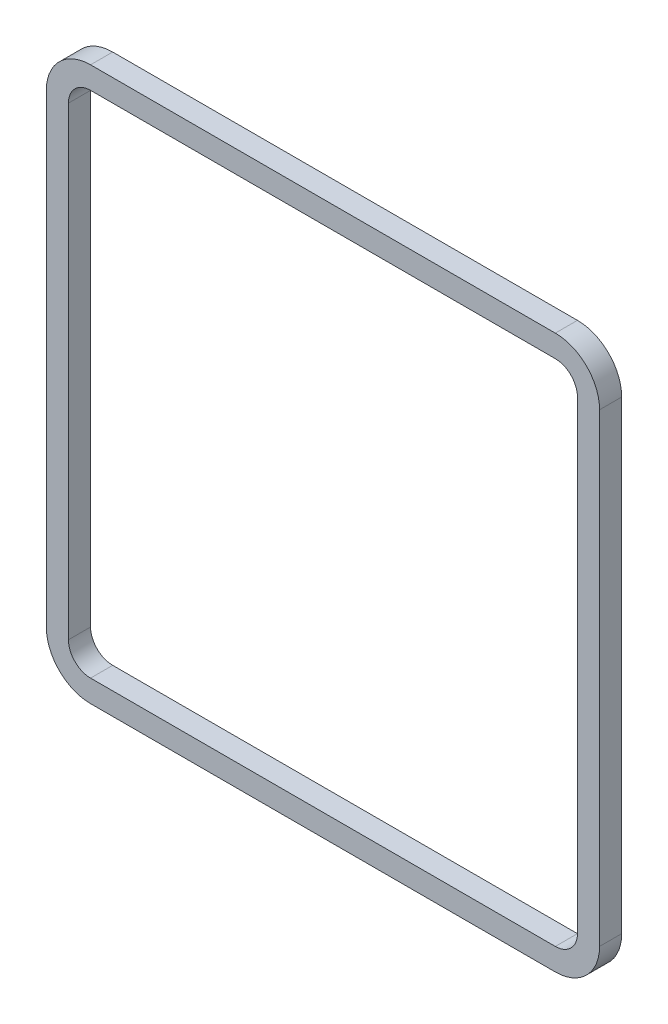
ISO-10303-21;
HEADER;
FILE_DESCRIPTION(('STEP AP214'),'2;1');
FILE_NAME('part.step','',(''),(''),'','','');
FILE_SCHEMA(('AUTOMOTIVE_DESIGN { 1 0 10303 214 1 1 1 1 }'));
ENDSEC;
DATA;
#1=APPLICATION_CONTEXT('core data for automotive mechanical design processes');
#2=APPLICATION_PROTOCOL_DEFINITION('international standard','automotive_design',2000,#1);
#3=PRODUCT_CONTEXT('',#1,'mechanical');
#4=PRODUCT('Part','Part','',(#3));
#5=PRODUCT_RELATED_PRODUCT_CATEGORY('part','',(#4));
#6=PRODUCT_DEFINITION_FORMATION('','',#4);
#7=PRODUCT_DEFINITION_CONTEXT('part definition',#1,'design');
#8=PRODUCT_DEFINITION('design','',#6,#7);
#9=PRODUCT_DEFINITION_SHAPE('','',#8);
#10=(LENGTH_UNIT() NAMED_UNIT(*) SI_UNIT(.MILLI.,.METRE.));
#11=(NAMED_UNIT(*) PLANE_ANGLE_UNIT() SI_UNIT($,.RADIAN.));
#12=(NAMED_UNIT(*) SI_UNIT($,.STERADIAN.) SOLID_ANGLE_UNIT());
#13=UNCERTAINTY_MEASURE_WITH_UNIT(LENGTH_MEASURE(1.E-05),#10,'distance_accuracy_value','');
#14=(GEOMETRIC_REPRESENTATION_CONTEXT(3) GLOBAL_UNCERTAINTY_ASSIGNED_CONTEXT((#13)) GLOBAL_UNIT_ASSIGNED_CONTEXT((#10,
#11,#12)) REPRESENTATION_CONTEXT('',''));
#15=CARTESIAN_POINT('',(0.,0.,0.));
#16=DIRECTION('',(0.,0.,1.));
#17=DIRECTION('',(1.,0.,0.));
#18=AXIS2_PLACEMENT_3D('',#15,#16,#17);
#19=CARTESIAN_POINT('',(53.34,53.34,5.08));
#20=DIRECTION('',(0.,0.,1.));
#21=DIRECTION('',(1.,0.,0.));
#22=AXIS2_PLACEMENT_3D('',#19,#20,#21);
#23=PLANE('',#22);
#24=CARTESIAN_POINT('',(53.34,53.34,5.08));
#25=DIRECTION('',(0.,0.,1.));
#26=DIRECTION('',(1.,0.,0.));
#27=AXIS2_PLACEMENT_3D('',#24,#25,#26);
#28=CIRCLE('',#27,10.16);
#29=CARTESIAN_POINT('',(63.5,53.3399999999999,5.08));
#30=VERTEX_POINT('',#29);
#31=CARTESIAN_POINT('',(53.3399999999999,63.5,5.08));
#32=VERTEX_POINT('',#31);
#33=EDGE_CURVE('E215',#30,#32,#28,.T.);
#34=ORIENTED_EDGE('',*,*,#33,.T.);
#35=DIRECTION('',(-1.,0.,0.));
#36=VECTOR('',#35,1.);
#37=CARTESIAN_POINT('',(53.3399999999999,63.5,5.08));
#38=LINE('',#37,#36);
#39=CARTESIAN_POINT('',(-53.3399999999999,63.5,5.08));
#40=VERTEX_POINT('',#39);
#41=EDGE_CURVE('E218',#32,#40,#38,.T.);
#42=ORIENTED_EDGE('',*,*,#41,.T.);
#43=CARTESIAN_POINT('',(-53.34,53.34,5.08));
#44=DIRECTION('',(0.,0.,1.));
#45=DIRECTION('',(1.,0.,0.));
#46=AXIS2_PLACEMENT_3D('',#43,#44,#45);
#47=CIRCLE('',#46,10.16);
#48=CARTESIAN_POINT('',(-63.5,53.3399999999999,5.08));
#49=VERTEX_POINT('',#48);
#50=EDGE_CURVE('E221',#40,#49,#47,.T.);
#51=ORIENTED_EDGE('',*,*,#50,.T.);
#52=DIRECTION('',(0.,-1.,0.));
#53=VECTOR('',#52,1.);
#54=CARTESIAN_POINT('',(-63.5,53.3399999999999,5.08));
#55=LINE('',#54,#53);
#56=CARTESIAN_POINT('',(-63.5,-53.34,5.08));
#57=VERTEX_POINT('',#56);
#58=EDGE_CURVE('E223',#49,#57,#55,.T.);
#59=ORIENTED_EDGE('',*,*,#58,.T.);
#60=CARTESIAN_POINT('',(-53.34,-53.34,5.08));
#61=DIRECTION('',(0.,0.,1.));
#62=DIRECTION('',(1.,0.,0.));
#63=AXIS2_PLACEMENT_3D('',#60,#61,#62);
#64=CIRCLE('',#63,10.16);
#65=CARTESIAN_POINT('',(-53.3399999999999,-63.5,5.08));
#66=VERTEX_POINT('',#65);
#67=EDGE_CURVE('E225',#57,#66,#64,.T.);
#68=ORIENTED_EDGE('',*,*,#67,.T.);
#69=DIRECTION('',(1.,0.,0.));
#70=VECTOR('',#69,1.);
#71=CARTESIAN_POINT('',(53.3399999999999,-63.5,5.08));
#72=LINE('',#71,#70);
#73=CARTESIAN_POINT('',(53.3399999999999,-63.5,5.08));
#74=VERTEX_POINT('',#73);
#75=EDGE_CURVE('E227',#66,#74,#72,.T.);
#76=ORIENTED_EDGE('',*,*,#75,.T.);
#77=CARTESIAN_POINT('',(53.34,-53.34,5.08));
#78=DIRECTION('',(0.,0.,1.));
#79=DIRECTION('',(1.,0.,0.));
#80=AXIS2_PLACEMENT_3D('',#77,#78,#79);
#81=CIRCLE('',#80,10.16);
#82=CARTESIAN_POINT('',(63.5,-53.3399999999999,5.08));
#83=VERTEX_POINT('',#82);
#84=EDGE_CURVE('E229',#74,#83,#81,.T.);
#85=ORIENTED_EDGE('',*,*,#84,.T.);
#86=DIRECTION('',(0.,1.,0.));
#87=VECTOR('',#86,1.);
#88=CARTESIAN_POINT('',(63.5,53.3399999999999,5.08));
#89=LINE('',#88,#87);
#90=EDGE_CURVE('E231',#83,#30,#89,.T.);
#91=ORIENTED_EDGE('',*,*,#90,.T.);
#92=EDGE_LOOP('',(#34,#42,#51,#59,#68,#76,#85,#91));
#93=FACE_BOUND('',#92,.T.);
#94=DIRECTION('',(-1.,0.,0.));
#95=VECTOR('',#94,1.);
#96=CARTESIAN_POINT('',(53.3399999999999,58.42,5.08));
#97=LINE('',#96,#95);
#98=CARTESIAN_POINT('',(53.3399999999999,58.42,5.08));
#99=VERTEX_POINT('',#98);
#100=CARTESIAN_POINT('',(-53.3399999999999,58.42,5.08));
#101=VERTEX_POINT('',#100);
#102=EDGE_CURVE('E158',#99,#101,#97,.T.);
#103=ORIENTED_EDGE('',*,*,#102,.F.);
#104=CARTESIAN_POINT('',(53.34,53.34,5.08));
#105=DIRECTION('',(0.,0.,1.));
#106=DIRECTION('',(1.,0.,0.));
#107=AXIS2_PLACEMENT_3D('',#104,#105,#106);
#108=CIRCLE('',#107,5.08);
#109=CARTESIAN_POINT('',(58.42,53.3399999999999,5.08));
#110=VERTEX_POINT('',#109);
#111=EDGE_CURVE('E150',#110,#99,#108,.T.);
#112=ORIENTED_EDGE('',*,*,#111,.F.);
#113=DIRECTION('',(0.,1.,0.));
#114=VECTOR('',#113,1.);
#115=CARTESIAN_POINT('',(58.42,53.3399999999999,5.08));
#116=LINE('',#115,#114);
#117=CARTESIAN_POINT('',(58.42,-53.34,5.08));
#118=VERTEX_POINT('',#117);
#119=EDGE_CURVE('E183',#118,#110,#116,.T.);
#120=ORIENTED_EDGE('',*,*,#119,.F.);
#121=CARTESIAN_POINT('',(53.34,-53.34,5.08));
#122=DIRECTION('',(0.,0.,1.));
#123=DIRECTION('',(1.,0.,0.));
#124=AXIS2_PLACEMENT_3D('',#121,#122,#123);
#125=CIRCLE('',#124,5.08);
#126=CARTESIAN_POINT('',(53.3399999999999,-58.42,5.08));
#127=VERTEX_POINT('',#126);
#128=EDGE_CURVE('E181',#127,#118,#125,.T.);
#129=ORIENTED_EDGE('',*,*,#128,.F.);
#130=DIRECTION('',(1.,0.,0.));
#131=VECTOR('',#130,1.);
#132=CARTESIAN_POINT('',(53.3399999999999,-58.42,5.08));
#133=LINE('',#132,#131);
#134=CARTESIAN_POINT('',(-53.34,-58.42,5.08));
#135=VERTEX_POINT('',#134);
#136=EDGE_CURVE('E179',#135,#127,#133,.T.);
#137=ORIENTED_EDGE('',*,*,#136,.F.);
#138=CARTESIAN_POINT('',(-53.34,-53.34,5.08));
#139=DIRECTION('',(0.,0.,1.));
#140=DIRECTION('',(1.,0.,0.));
#141=AXIS2_PLACEMENT_3D('',#138,#139,#140);
#142=CIRCLE('',#141,5.08000000000001);
#143=CARTESIAN_POINT('',(-58.42,-53.34,5.08));
#144=VERTEX_POINT('',#143);
#145=EDGE_CURVE('E177',#144,#135,#142,.T.);
#146=ORIENTED_EDGE('',*,*,#145,.F.);
#147=DIRECTION('',(0.,-1.,0.));
#148=VECTOR('',#147,1.);
#149=CARTESIAN_POINT('',(-58.42,53.3399999999999,5.08));
#150=LINE('',#149,#148);
#151=CARTESIAN_POINT('',(-58.42,53.3399999999999,5.08));
#152=VERTEX_POINT('',#151);
#153=EDGE_CURVE('E173',#152,#144,#150,.T.);
#154=ORIENTED_EDGE('',*,*,#153,.F.);
#155=CARTESIAN_POINT('',(-53.34,53.34,5.08));
#156=DIRECTION('',(0.,0.,1.));
#157=DIRECTION('',(1.,0.,0.));
#158=AXIS2_PLACEMENT_3D('',#155,#156,#157);
#159=CIRCLE('',#158,5.08);
#160=EDGE_CURVE('E171',#101,#152,#159,.T.);
#161=ORIENTED_EDGE('',*,*,#160,.F.);
#162=EDGE_LOOP('',(#103,#112,#120,#129,#137,#146,#154,#161));
#163=FACE_BOUND('',#162,.T.);
#164=ADVANCED_FACE('F37',(#93,#163),#23,.T.);
#165=CARTESIAN_POINT('',(53.34,53.34,0.));
#166=DIRECTION('',(0.,0.,1.));
#167=DIRECTION('',(1.,0.,0.));
#168=AXIS2_PLACEMENT_3D('',#165,#166,#167);
#169=PLANE('',#168);
#170=CARTESIAN_POINT('',(53.34,53.34,0.));
#171=DIRECTION('',(0.,0.,1.));
#172=DIRECTION('',(1.,0.,0.));
#173=AXIS2_PLACEMENT_3D('',#170,#171,#172);
#174=CIRCLE('',#173,10.16);
#175=CARTESIAN_POINT('',(63.5,53.3399999999999,0.));
#176=VERTEX_POINT('',#175);
#177=CARTESIAN_POINT('',(53.3399999999999,63.5,0.));
#178=VERTEX_POINT('',#177);
#179=EDGE_CURVE('E166',#176,#178,#174,.T.);
#180=ORIENTED_EDGE('',*,*,#179,.F.);
#181=DIRECTION('',(0.,1.,0.));
#182=VECTOR('',#181,1.);
#183=CARTESIAN_POINT('',(63.5,53.3399999999999,0.));
#184=LINE('',#183,#182);
#185=CARTESIAN_POINT('',(63.5,-53.3399999999999,0.));
#186=VERTEX_POINT('',#185);
#187=EDGE_CURVE('E219',#186,#176,#184,.T.);
#188=ORIENTED_EDGE('',*,*,#187,.F.);
#189=CARTESIAN_POINT('',(53.34,-53.34,0.));
#190=DIRECTION('',(0.,0.,1.));
#191=DIRECTION('',(1.,0.,0.));
#192=AXIS2_PLACEMENT_3D('',#189,#190,#191);
#193=CIRCLE('',#192,10.16);
#194=CARTESIAN_POINT('',(53.3399999999999,-63.5,0.));
#195=VERTEX_POINT('',#194);
#196=EDGE_CURVE('E246',#195,#186,#193,.T.);
#197=ORIENTED_EDGE('',*,*,#196,.F.);
#198=DIRECTION('',(1.,0.,0.));
#199=VECTOR('',#198,1.);
#200=CARTESIAN_POINT('',(53.3399999999999,-63.5,0.));
#201=LINE('',#200,#199);
#202=CARTESIAN_POINT('',(-53.3399999999999,-63.5,0.));
#203=VERTEX_POINT('',#202);
#204=EDGE_CURVE('E244',#203,#195,#201,.T.);
#205=ORIENTED_EDGE('',*,*,#204,.F.);
#206=CARTESIAN_POINT('',(-53.34,-53.34,0.));
#207=DIRECTION('',(0.,0.,1.));
#208=DIRECTION('',(1.,0.,0.));
#209=AXIS2_PLACEMENT_3D('',#206,#207,#208);
#210=CIRCLE('',#209,10.16);
#211=CARTESIAN_POINT('',(-63.5,-53.34,0.));
#212=VERTEX_POINT('',#211);
#213=EDGE_CURVE('E242',#212,#203,#210,.T.);
#214=ORIENTED_EDGE('',*,*,#213,.F.);
#215=DIRECTION('',(0.,-1.,0.));
#216=VECTOR('',#215,1.);
#217=CARTESIAN_POINT('',(-63.5,53.3399999999999,0.));
#218=LINE('',#217,#216);
#219=CARTESIAN_POINT('',(-63.5,53.3399999999999,0.));
#220=VERTEX_POINT('',#219);
#221=EDGE_CURVE('E240',#220,#212,#218,.T.);
#222=ORIENTED_EDGE('',*,*,#221,.F.);
#223=CARTESIAN_POINT('',(-53.34,53.34,0.));
#224=DIRECTION('',(0.,0.,1.));
#225=DIRECTION('',(1.,0.,0.));
#226=AXIS2_PLACEMENT_3D('',#223,#224,#225);
#227=CIRCLE('',#226,10.16);
#228=CARTESIAN_POINT('',(-53.3399999999999,63.5,0.));
#229=VERTEX_POINT('',#228);
#230=EDGE_CURVE('E238',#229,#220,#227,.T.);
#231=ORIENTED_EDGE('',*,*,#230,.F.);
#232=DIRECTION('',(-1.,0.,0.));
#233=VECTOR('',#232,1.);
#234=CARTESIAN_POINT('',(53.3399999999999,63.5,0.));
#235=LINE('',#234,#233);
#236=EDGE_CURVE('E236',#178,#229,#235,.T.);
#237=ORIENTED_EDGE('',*,*,#236,.F.);
#238=EDGE_LOOP('',(#180,#188,#197,#205,#214,#222,#231,#237));
#239=FACE_BOUND('',#238,.T.);
#240=CARTESIAN_POINT('',(53.34,53.34,0.));
#241=DIRECTION('',(0.,0.,1.));
#242=DIRECTION('',(1.,0.,0.));
#243=AXIS2_PLACEMENT_3D('',#240,#241,#242);
#244=CIRCLE('',#243,5.08);
#245=CARTESIAN_POINT('',(58.42,53.3399999999999,0.));
#246=VERTEX_POINT('',#245);
#247=CARTESIAN_POINT('',(53.3399999999999,58.42,0.));
#248=VERTEX_POINT('',#247);
#249=EDGE_CURVE('E60',#246,#248,#244,.T.);
#250=ORIENTED_EDGE('',*,*,#249,.T.);
#251=DIRECTION('',(-1.,0.,0.));
#252=VECTOR('',#251,1.);
#253=CARTESIAN_POINT('',(53.3399999999999,58.42,0.));
#254=LINE('',#253,#252);
#255=CARTESIAN_POINT('',(-53.3399999999999,58.42,0.));
#256=VERTEX_POINT('',#255);
#257=EDGE_CURVE('E165',#248,#256,#254,.T.);
#258=ORIENTED_EDGE('',*,*,#257,.T.);
#259=CARTESIAN_POINT('',(-53.34,53.34,0.));
#260=DIRECTION('',(0.,0.,1.));
#261=DIRECTION('',(1.,0.,0.));
#262=AXIS2_PLACEMENT_3D('',#259,#260,#261);
#263=CIRCLE('',#262,5.08);
#264=CARTESIAN_POINT('',(-58.42,53.3399999999999,0.));
#265=VERTEX_POINT('',#264);
#266=EDGE_CURVE('E187',#256,#265,#263,.T.);
#267=ORIENTED_EDGE('',*,*,#266,.T.);
#268=DIRECTION('',(0.,-1.,0.));
#269=VECTOR('',#268,1.);
#270=CARTESIAN_POINT('',(-58.42,53.3399999999999,0.));
#271=LINE('',#270,#269);
#272=CARTESIAN_POINT('',(-58.42,-53.34,0.));
#273=VERTEX_POINT('',#272);
#274=EDGE_CURVE('E190',#265,#273,#271,.T.);
#275=ORIENTED_EDGE('',*,*,#274,.T.);
#276=CARTESIAN_POINT('',(-53.34,-53.34,0.));
#277=DIRECTION('',(0.,0.,1.));
#278=DIRECTION('',(1.,0.,0.));
#279=AXIS2_PLACEMENT_3D('',#276,#277,#278);
#280=CIRCLE('',#279,5.08000000000001);
#281=CARTESIAN_POINT('',(-53.34,-58.42,0.));
#282=VERTEX_POINT('',#281);
#283=EDGE_CURVE('E193',#273,#282,#280,.T.);
#284=ORIENTED_EDGE('',*,*,#283,.T.);
#285=DIRECTION('',(1.,0.,0.));
#286=VECTOR('',#285,1.);
#287=CARTESIAN_POINT('',(53.3399999999999,-58.42,0.));
#288=LINE('',#287,#286);
#289=CARTESIAN_POINT('',(53.3399999999999,-58.42,0.));
#290=VERTEX_POINT('',#289);
#291=EDGE_CURVE('E196',#282,#290,#288,.T.);
#292=ORIENTED_EDGE('',*,*,#291,.T.);
#293=CARTESIAN_POINT('',(53.34,-53.34,0.));
#294=DIRECTION('',(0.,0.,1.));
#295=DIRECTION('',(1.,0.,0.));
#296=AXIS2_PLACEMENT_3D('',#293,#294,#295);
#297=CIRCLE('',#296,5.08);
#298=CARTESIAN_POINT('',(58.42,-53.34,0.));
#299=VERTEX_POINT('',#298);
#300=EDGE_CURVE('E199',#290,#299,#297,.T.);
#301=ORIENTED_EDGE('',*,*,#300,.T.);
#302=DIRECTION('',(0.,1.,0.));
#303=VECTOR('',#302,1.);
#304=CARTESIAN_POINT('',(58.42,53.3399999999999,0.));
#305=LINE('',#304,#303);
#306=EDGE_CURVE('E159',#299,#246,#305,.T.);
#307=ORIENTED_EDGE('',*,*,#306,.T.);
#308=EDGE_LOOP('',(#250,#258,#267,#275,#284,#292,#301,#307));
#309=FACE_BOUND('',#308,.T.);
#310=ADVANCED_FACE('F276',(#239,#309),#169,.F.);
#311=CARTESIAN_POINT('',(53.34,53.34,5.08));
#312=DIRECTION('',(0.,0.,-1.));
#313=DIRECTION('',(-1.,0.,0.));
#314=AXIS2_PLACEMENT_3D('',#311,#312,#313);
#315=CYLINDRICAL_SURFACE('',#314,10.16);
#316=ORIENTED_EDGE('',*,*,#179,.T.);
#317=DIRECTION('',(0.,0.,-1.));
#318=VECTOR('',#317,1.);
#319=CARTESIAN_POINT('',(53.3399999999999,63.5,5.08));
#320=LINE('',#319,#318);
#321=EDGE_CURVE('E11',#32,#178,#320,.T.);
#322=ORIENTED_EDGE('',*,*,#321,.F.);
#323=ORIENTED_EDGE('',*,*,#33,.F.);
#324=DIRECTION('',(0.,0.,-1.));
#325=VECTOR('',#324,1.);
#326=CARTESIAN_POINT('',(63.5,53.3399999999999,5.08));
#327=LINE('',#326,#325);
#328=EDGE_CURVE('E233',#30,#176,#327,.T.);
#329=ORIENTED_EDGE('',*,*,#328,.T.);
#330=EDGE_LOOP('',(#316,#322,#323,#329));
#331=FACE_BOUND('',#330,.T.);
#332=ADVANCED_FACE('F39',(#331),#315,.T.);
#333=CARTESIAN_POINT('',(53.3399999999999,63.5,5.08));
#334=DIRECTION('',(0.,-1.,0.));
#335=DIRECTION('',(1.,0.,0.));
#336=AXIS2_PLACEMENT_3D('',#333,#334,#335);
#337=PLANE('',#336);
#338=ORIENTED_EDGE('',*,*,#236,.T.);
#339=DIRECTION('',(0.,0.,-1.));
#340=VECTOR('',#339,1.);
#341=CARTESIAN_POINT('',(-53.3399999999999,63.5,5.08));
#342=LINE('',#341,#340);
#343=EDGE_CURVE('E45',#40,#229,#342,.T.);
#344=ORIENTED_EDGE('',*,*,#343,.F.);
#345=ORIENTED_EDGE('',*,*,#41,.F.);
#346=ORIENTED_EDGE('',*,*,#321,.T.);
#347=EDGE_LOOP('',(#338,#344,#345,#346));
#348=FACE_BOUND('',#347,.T.);
#349=ADVANCED_FACE('F293',(#348),#337,.F.);
#350=CARTESIAN_POINT('',(-53.34,53.34,5.08));
#351=DIRECTION('',(0.,0.,-1.));
#352=DIRECTION('',(-1.,0.,0.));
#353=AXIS2_PLACEMENT_3D('',#350,#351,#352);
#354=CYLINDRICAL_SURFACE('',#353,10.16);
#355=ORIENTED_EDGE('',*,*,#230,.T.);
#356=DIRECTION('',(0.,0.,-1.));
#357=VECTOR('',#356,1.);
#358=CARTESIAN_POINT('',(-63.5,53.3399999999999,5.08));
#359=LINE('',#358,#357);
#360=EDGE_CURVE('E263',#49,#220,#359,.T.);
#361=ORIENTED_EDGE('',*,*,#360,.F.);
#362=ORIENTED_EDGE('',*,*,#50,.F.);
#363=ORIENTED_EDGE('',*,*,#343,.T.);
#364=EDGE_LOOP('',(#355,#361,#362,#363));
#365=FACE_BOUND('',#364,.T.);
#366=ADVANCED_FACE('F270',(#365),#354,.T.);
#367=CARTESIAN_POINT('',(-63.5,53.3399999999999,5.08));
#368=DIRECTION('',(1.,0.,0.));
#369=DIRECTION('',(0.,1.,0.));
#370=AXIS2_PLACEMENT_3D('',#367,#368,#369);
#371=PLANE('',#370);
#372=ORIENTED_EDGE('',*,*,#221,.T.);
#373=DIRECTION('',(0.,0.,-1.));
#374=VECTOR('',#373,1.);
#375=CARTESIAN_POINT('',(-63.5,-53.34,5.08));
#376=LINE('',#375,#374);
#377=EDGE_CURVE('E260',#57,#212,#376,.T.);
#378=ORIENTED_EDGE('',*,*,#377,.F.);
#379=ORIENTED_EDGE('',*,*,#58,.F.);
#380=ORIENTED_EDGE('',*,*,#360,.T.);
#381=EDGE_LOOP('',(#372,#378,#379,#380));
#382=FACE_BOUND('',#381,.T.);
#383=ADVANCED_FACE('F282',(#382),#371,.F.);
#384=CARTESIAN_POINT('',(-53.34,-53.34,5.08));
#385=DIRECTION('',(0.,0.,-1.));
#386=DIRECTION('',(-1.,0.,0.));
#387=AXIS2_PLACEMENT_3D('',#384,#385,#386);
#388=CYLINDRICAL_SURFACE('',#387,10.16);
#389=ORIENTED_EDGE('',*,*,#213,.T.);
#390=DIRECTION('',(0.,0.,-1.));
#391=VECTOR('',#390,1.);
#392=CARTESIAN_POINT('',(-53.3399999999999,-63.5,5.08));
#393=LINE('',#392,#391);
#394=EDGE_CURVE('E257',#66,#203,#393,.T.);
#395=ORIENTED_EDGE('',*,*,#394,.F.);
#396=ORIENTED_EDGE('',*,*,#67,.F.);
#397=ORIENTED_EDGE('',*,*,#377,.T.);
#398=EDGE_LOOP('',(#389,#395,#396,#397));
#399=FACE_BOUND('',#398,.T.);
#400=ADVANCED_FACE('F286',(#399),#388,.T.);
#401=CARTESIAN_POINT('',(53.3399999999999,-63.5,5.08));
#402=DIRECTION('',(0.,1.,0.));
#403=DIRECTION('',(-1.,0.,0.));
#404=AXIS2_PLACEMENT_3D('',#401,#402,#403);
#405=PLANE('',#404);
#406=ORIENTED_EDGE('',*,*,#204,.T.);
#407=DIRECTION('',(0.,0.,-1.));
#408=VECTOR('',#407,1.);
#409=CARTESIAN_POINT('',(53.3399999999999,-63.5,5.08));
#410=LINE('',#409,#408);
#411=EDGE_CURVE('E254',#74,#195,#410,.T.);
#412=ORIENTED_EDGE('',*,*,#411,.F.);
#413=ORIENTED_EDGE('',*,*,#75,.F.);
#414=ORIENTED_EDGE('',*,*,#394,.T.);
#415=EDGE_LOOP('',(#406,#412,#413,#414));
#416=FACE_BOUND('',#415,.T.);
#417=ADVANCED_FACE('F306',(#416),#405,.F.);
#418=CARTESIAN_POINT('',(53.34,-53.34,5.08));
#419=DIRECTION('',(0.,0.,-1.));
#420=DIRECTION('',(-1.,0.,0.));
#421=AXIS2_PLACEMENT_3D('',#418,#419,#420);
#422=CYLINDRICAL_SURFACE('',#421,10.16);
#423=ORIENTED_EDGE('',*,*,#196,.T.);
#424=DIRECTION('',(0.,0.,-1.));
#425=VECTOR('',#424,1.);
#426=CARTESIAN_POINT('',(63.5,-53.3399999999999,5.08));
#427=LINE('',#426,#425);
#428=EDGE_CURVE('E251',#83,#186,#427,.T.);
#429=ORIENTED_EDGE('',*,*,#428,.F.);
#430=ORIENTED_EDGE('',*,*,#84,.F.);
#431=ORIENTED_EDGE('',*,*,#411,.T.);
#432=EDGE_LOOP('',(#423,#429,#430,#431));
#433=FACE_BOUND('',#432,.T.);
#434=ADVANCED_FACE('F304',(#433),#422,.T.);
#435=CARTESIAN_POINT('',(63.5,53.3399999999999,5.08));
#436=DIRECTION('',(-1.,0.,0.));
#437=DIRECTION('',(0.,-1.,0.));
#438=AXIS2_PLACEMENT_3D('',#435,#436,#437);
#439=PLANE('',#438);
#440=ORIENTED_EDGE('',*,*,#187,.T.);
#441=ORIENTED_EDGE('',*,*,#328,.F.);
#442=ORIENTED_EDGE('',*,*,#90,.F.);
#443=ORIENTED_EDGE('',*,*,#428,.T.);
#444=EDGE_LOOP('',(#440,#441,#442,#443));
#445=FACE_BOUND('',#444,.T.);
#446=ADVANCED_FACE('F299',(#445),#439,.F.);
#447=CARTESIAN_POINT('',(53.34,53.34,5.08));
#448=DIRECTION('',(0.,0.,-1.));
#449=DIRECTION('',(-1.,0.,0.));
#450=AXIS2_PLACEMENT_3D('',#447,#448,#449);
#451=CYLINDRICAL_SURFACE('',#450,5.08);
#452=ORIENTED_EDGE('',*,*,#249,.F.);
#453=DIRECTION('',(0.,0.,-1.));
#454=VECTOR('',#453,1.);
#455=CARTESIAN_POINT('',(58.42,53.3399999999999,5.08));
#456=LINE('',#455,#454);
#457=EDGE_CURVE('E154',#110,#246,#456,.T.);
#458=ORIENTED_EDGE('',*,*,#457,.F.);
#459=ORIENTED_EDGE('',*,*,#111,.T.);
#460=DIRECTION('',(0.,0.,-1.));
#461=VECTOR('',#460,1.);
#462=CARTESIAN_POINT('',(53.3399999999999,58.42,5.08));
#463=LINE('',#462,#461);
#464=EDGE_CURVE('E153',#99,#248,#463,.T.);
#465=ORIENTED_EDGE('',*,*,#464,.T.);
#466=EDGE_LOOP('',(#452,#458,#459,#465));
#467=FACE_BOUND('',#466,.T.);
#468=ADVANCED_FACE('F152',(#467),#451,.F.);
#469=CARTESIAN_POINT('',(53.3399999999999,58.42,5.08));
#470=DIRECTION('',(0.,-1.,0.));
#471=DIRECTION('',(0.,0.,-1.));
#472=AXIS2_PLACEMENT_3D('',#469,#470,#471);
#473=PLANE('',#472);
#474=ORIENTED_EDGE('',*,*,#257,.F.);
#475=ORIENTED_EDGE('',*,*,#464,.F.);
#476=ORIENTED_EDGE('',*,*,#102,.T.);
#477=DIRECTION('',(0.,0.,-1.));
#478=VECTOR('',#477,1.);
#479=CARTESIAN_POINT('',(-53.3399999999999,58.42,5.08));
#480=LINE('',#479,#478);
#481=EDGE_CURVE('E167',#101,#256,#480,.T.);
#482=ORIENTED_EDGE('',*,*,#481,.T.);
#483=EDGE_LOOP('',(#474,#475,#476,#482));
#484=FACE_BOUND('',#483,.T.);
#485=ADVANCED_FACE('F162',(#484),#473,.T.);
#486=CARTESIAN_POINT('',(-53.34,53.34,5.08));
#487=DIRECTION('',(0.,0.,-1.));
#488=DIRECTION('',(-1.,0.,0.));
#489=AXIS2_PLACEMENT_3D('',#486,#487,#488);
#490=CYLINDRICAL_SURFACE('',#489,5.08);
#491=ORIENTED_EDGE('',*,*,#266,.F.);
#492=ORIENTED_EDGE('',*,*,#481,.F.);
#493=ORIENTED_EDGE('',*,*,#160,.T.);
#494=DIRECTION('',(0.,0.,-1.));
#495=VECTOR('',#494,1.);
#496=CARTESIAN_POINT('',(-58.42,53.3399999999999,5.08));
#497=LINE('',#496,#495);
#498=EDGE_CURVE('E212',#152,#265,#497,.T.);
#499=ORIENTED_EDGE('',*,*,#498,.T.);
#500=EDGE_LOOP('',(#491,#492,#493,#499));
#501=FACE_BOUND('',#500,.T.);
#502=ADVANCED_FACE('F331',(#501),#490,.F.);
#503=CARTESIAN_POINT('',(-58.42,53.3399999999999,5.08));
#504=DIRECTION('',(1.,0.,0.));
#505=DIRECTION('',(0.,0.,-1.));
#506=AXIS2_PLACEMENT_3D('',#503,#504,#505);
#507=PLANE('',#506);
#508=ORIENTED_EDGE('',*,*,#274,.F.);
#509=ORIENTED_EDGE('',*,*,#498,.F.);
#510=ORIENTED_EDGE('',*,*,#153,.T.);
#511=DIRECTION('',(0.,0.,-1.));
#512=VECTOR('',#511,1.);
#513=CARTESIAN_POINT('',(-58.42,-53.34,5.08));
#514=LINE('',#513,#512);
#515=EDGE_CURVE('E210',#144,#273,#514,.T.);
#516=ORIENTED_EDGE('',*,*,#515,.T.);
#517=EDGE_LOOP('',(#508,#509,#510,#516));
#518=FACE_BOUND('',#517,.T.);
#519=ADVANCED_FACE('F335',(#518),#507,.T.);
#520=CARTESIAN_POINT('',(-53.34,-53.34,5.08));
#521=DIRECTION('',(0.,0.,-1.));
#522=DIRECTION('',(-1.,0.,0.));
#523=AXIS2_PLACEMENT_3D('',#520,#521,#522);
#524=CYLINDRICAL_SURFACE('',#523,5.08000000000001);
#525=ORIENTED_EDGE('',*,*,#283,.F.);
#526=ORIENTED_EDGE('',*,*,#515,.F.);
#527=ORIENTED_EDGE('',*,*,#145,.T.);
#528=DIRECTION('',(0.,0.,-1.));
#529=VECTOR('',#528,1.);
#530=CARTESIAN_POINT('',(-53.34,-58.42,5.08));
#531=LINE('',#530,#529);
#532=EDGE_CURVE('E208',#135,#282,#531,.T.);
#533=ORIENTED_EDGE('',*,*,#532,.T.);
#534=EDGE_LOOP('',(#525,#526,#527,#533));
#535=FACE_BOUND('',#534,.T.);
#536=ADVANCED_FACE('F341',(#535),#524,.F.);
#537=CARTESIAN_POINT('',(53.3399999999999,-58.42,5.08));
#538=DIRECTION('',(0.,1.,0.));
#539=DIRECTION('',(-1.,0.,0.));
#540=AXIS2_PLACEMENT_3D('',#537,#538,#539);
#541=PLANE('',#540);
#542=ORIENTED_EDGE('',*,*,#291,.F.);
#543=ORIENTED_EDGE('',*,*,#532,.F.);
#544=ORIENTED_EDGE('',*,*,#136,.T.);
#545=DIRECTION('',(0.,0.,-1.));
#546=VECTOR('',#545,1.);
#547=CARTESIAN_POINT('',(53.3399999999999,-58.42,5.08));
#548=LINE('',#547,#546);
#549=EDGE_CURVE('E206',#127,#290,#548,.T.);
#550=ORIENTED_EDGE('',*,*,#549,.T.);
#551=EDGE_LOOP('',(#542,#543,#544,#550));
#552=FACE_BOUND('',#551,.T.);
#553=ADVANCED_FACE('F345',(#552),#541,.T.);
#554=CARTESIAN_POINT('',(53.34,-53.34,5.08));
#555=DIRECTION('',(0.,0.,-1.));
#556=DIRECTION('',(-1.,0.,0.));
#557=AXIS2_PLACEMENT_3D('',#554,#555,#556);
#558=CYLINDRICAL_SURFACE('',#557,5.08);
#559=ORIENTED_EDGE('',*,*,#300,.F.);
#560=ORIENTED_EDGE('',*,*,#549,.F.);
#561=ORIENTED_EDGE('',*,*,#128,.T.);
#562=DIRECTION('',(0.,0.,-1.));
#563=VECTOR('',#562,1.);
#564=CARTESIAN_POINT('',(58.42,-53.34,5.08));
#565=LINE('',#564,#563);
#566=EDGE_CURVE('E52',#118,#299,#565,.T.);
#567=ORIENTED_EDGE('',*,*,#566,.T.);
#568=EDGE_LOOP('',(#559,#560,#561,#567));
#569=FACE_BOUND('',#568,.T.);
#570=ADVANCED_FACE('F349',(#569),#558,.F.);
#571=CARTESIAN_POINT('',(58.42,53.3399999999999,5.08));
#572=DIRECTION('',(-1.,0.,0.));
#573=DIRECTION('',(0.,-1.,0.));
#574=AXIS2_PLACEMENT_3D('',#571,#572,#573);
#575=PLANE('',#574);
#576=ORIENTED_EDGE('',*,*,#306,.F.);
#577=ORIENTED_EDGE('',*,*,#566,.F.);
#578=ORIENTED_EDGE('',*,*,#119,.T.);
#579=ORIENTED_EDGE('',*,*,#457,.T.);
#580=EDGE_LOOP('',(#576,#577,#578,#579));
#581=FACE_BOUND('',#580,.T.);
#582=ADVANCED_FACE('F353',(#581),#575,.T.);
#583=CLOSED_SHELL('',(#164,#310,#332,#349,#366,#383,#400,#417,#434,#446,#468,#485,#502,#519,
#536,#553,#570,#582));
#584=MANIFOLD_SOLID_BREP('B2',#583);
#585=ADVANCED_BREP_SHAPE_REPRESENTATION('',(#18,#584),#14);
#586=SHAPE_DEFINITION_REPRESENTATION(#9,#585);
ENDSEC;
END-ISO-10303-21;
